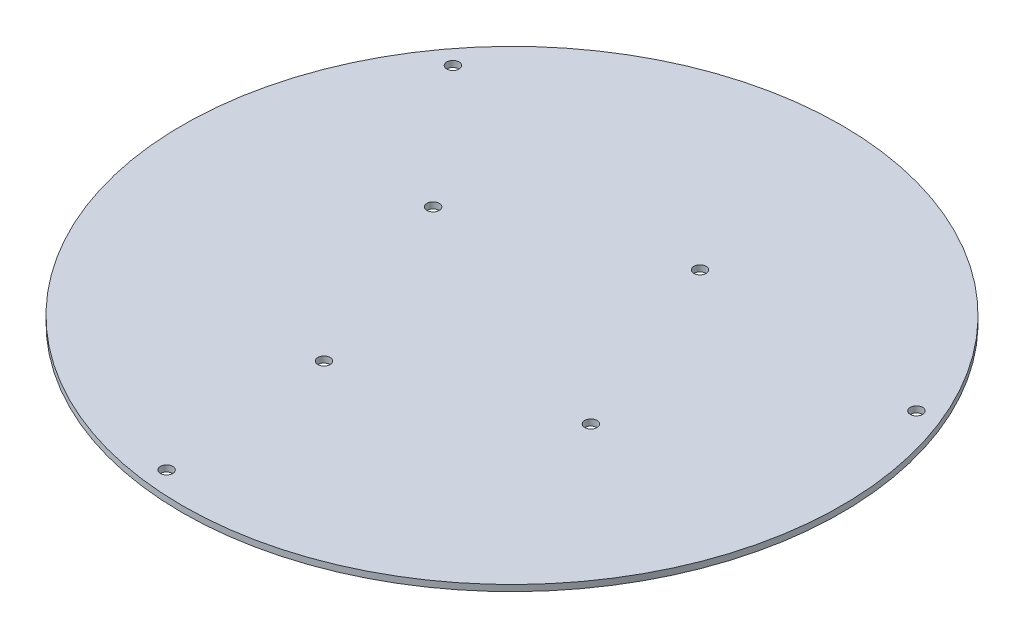
ISO-10303-21;
HEADER;
FILE_DESCRIPTION(('STEP AP214'),'2;1');
FILE_NAME('part.step','',(''),(''),'','','');
FILE_SCHEMA(('AUTOMOTIVE_DESIGN { 1 0 10303 214 1 1 1 1 }'));
ENDSEC;
DATA;
#1=APPLICATION_CONTEXT('core data for automotive mechanical design processes');
#2=APPLICATION_PROTOCOL_DEFINITION('international standard','automotive_design',2000,#1);
#3=PRODUCT_CONTEXT('',#1,'mechanical');
#4=PRODUCT('Part','Part','',(#3));
#5=PRODUCT_RELATED_PRODUCT_CATEGORY('part','',(#4));
#6=PRODUCT_DEFINITION_FORMATION('','',#4);
#7=PRODUCT_DEFINITION_CONTEXT('part definition',#1,'design');
#8=PRODUCT_DEFINITION('design','',#6,#7);
#9=PRODUCT_DEFINITION_SHAPE('','',#8);
#10=(LENGTH_UNIT() NAMED_UNIT(*) SI_UNIT(.MILLI.,.METRE.));
#11=(NAMED_UNIT(*) PLANE_ANGLE_UNIT() SI_UNIT($,.RADIAN.));
#12=(NAMED_UNIT(*) SI_UNIT($,.STERADIAN.) SOLID_ANGLE_UNIT());
#13=UNCERTAINTY_MEASURE_WITH_UNIT(LENGTH_MEASURE(1.E-05),#10,'distance_accuracy_value','');
#14=(GEOMETRIC_REPRESENTATION_CONTEXT(3) GLOBAL_UNCERTAINTY_ASSIGNED_CONTEXT((#13)) GLOBAL_UNIT_ASSIGNED_CONTEXT((#10,
#11,#12)) REPRESENTATION_CONTEXT('',''));
#15=CARTESIAN_POINT('',(0.,0.,0.));
#16=DIRECTION('',(0.,0.,1.));
#17=DIRECTION('',(1.,0.,0.));
#18=AXIS2_PLACEMENT_3D('',#15,#16,#17);
#19=CARTESIAN_POINT('',(138.313767790444,3.,-58.0456857967166));
#20=DIRECTION('',(0.,-1.,0.));
#21=DIRECTION('',(0.,0.,-1.));
#22=AXIS2_PLACEMENT_3D('',#19,#20,#21);
#23=CYLINDRICAL_SURFACE('',#22,2.99999999999999);
#24=CARTESIAN_POINT('',(138.313767790444,3.,-58.0456857967166));
#25=DIRECTION('',(0.,1.,0.));
#26=DIRECTION('',(0.,0.,1.));
#27=AXIS2_PLACEMENT_3D('',#24,#25,#26);
#28=CIRCLE('',#27,2.99999999999999);
#29=CARTESIAN_POINT('',(138.313767790444,3.,-55.0456857967166));
#30=VERTEX_POINT('',#29);
#31=EDGE_CURVE('E49',#30,#30,#28,.T.);
#32=ORIENTED_EDGE('',*,*,#31,.T.);
#33=EDGE_LOOP('',(#32));
#34=FACE_BOUND('',#33,.T.);
#35=CARTESIAN_POINT('',(138.313767790444,0.,-58.0456857967166));
#36=DIRECTION('',(0.,1.,0.));
#37=DIRECTION('',(0.,0.,1.));
#38=AXIS2_PLACEMENT_3D('',#35,#36,#37);
#39=CIRCLE('',#38,2.99999999999999);
#40=CARTESIAN_POINT('',(138.313767790444,0.,-55.0456857967166));
#41=VERTEX_POINT('',#40);
#42=EDGE_CURVE('E75',#41,#41,#39,.T.);
#43=ORIENTED_EDGE('',*,*,#42,.F.);
#44=EDGE_LOOP('',(#43));
#45=FACE_BOUND('',#44,.T.);
#46=ADVANCED_FACE('F41',(#34,#45),#23,.F.);
#47=CARTESIAN_POINT('',(-18.8878454151745,3.,148.806079498025));
#48=DIRECTION('',(0.,-1.,0.));
#49=DIRECTION('',(0.,0.,-1.));
#50=AXIS2_PLACEMENT_3D('',#47,#48,#49);
#51=CYLINDRICAL_SURFACE('',#50,3.);
#52=CARTESIAN_POINT('',(-18.8878454151745,3.,148.806079498025));
#53=DIRECTION('',(0.,1.,0.));
#54=DIRECTION('',(0.,0.,1.));
#55=AXIS2_PLACEMENT_3D('',#52,#53,#54);
#56=CIRCLE('',#55,3.);
#57=CARTESIAN_POINT('',(-18.8878454151745,3.,151.806079498025));
#58=VERTEX_POINT('',#57);
#59=EDGE_CURVE('E54',#58,#58,#56,.T.);
#60=ORIENTED_EDGE('',*,*,#59,.T.);
#61=EDGE_LOOP('',(#60));
#62=FACE_BOUND('',#61,.T.);
#63=CARTESIAN_POINT('',(-18.8878454151745,0.,148.806079498025));
#64=DIRECTION('',(0.,1.,0.));
#65=DIRECTION('',(0.,0.,1.));
#66=AXIS2_PLACEMENT_3D('',#63,#64,#65);
#67=CIRCLE('',#66,3.);
#68=CARTESIAN_POINT('',(-18.8878454151745,0.,151.806079498025));
#69=VERTEX_POINT('',#68);
#70=EDGE_CURVE('E73',#69,#69,#67,.T.);
#71=ORIENTED_EDGE('',*,*,#70,.F.);
#72=EDGE_LOOP('',(#71));
#73=FACE_BOUND('',#72,.T.);
#74=ADVANCED_FACE('F102',(#62,#73),#51,.F.);
#75=CARTESIAN_POINT('',(-64.7948768944695,3.,-26.4881846911137));
#76=DIRECTION('',(0.,-1.,0.));
#77=DIRECTION('',(0.,0.,-1.));
#78=AXIS2_PLACEMENT_3D('',#75,#76,#77);
#79=CYLINDRICAL_SURFACE('',#78,3.00000000000001);
#80=CARTESIAN_POINT('',(-64.7948768944695,3.,-26.4881846911137));
#81=DIRECTION('',(0.,1.,0.));
#82=DIRECTION('',(0.,0.,1.));
#83=AXIS2_PLACEMENT_3D('',#80,#81,#82);
#84=CIRCLE('',#83,3.00000000000001);
#85=CARTESIAN_POINT('',(-64.7948768944695,3.,-23.4881846911137));
#86=VERTEX_POINT('',#85);
#87=EDGE_CURVE('E97',#86,#86,#84,.T.);
#88=ORIENTED_EDGE('',*,*,#87,.T.);
#89=EDGE_LOOP('',(#88));
#90=FACE_BOUND('',#89,.T.);
#91=CARTESIAN_POINT('',(-64.7948768944695,0.,-26.4881846911137));
#92=DIRECTION('',(0.,1.,0.));
#93=DIRECTION('',(0.,0.,1.));
#94=AXIS2_PLACEMENT_3D('',#91,#92,#93);
#95=CIRCLE('',#94,3.00000000000001);
#96=CARTESIAN_POINT('',(-64.7948768944695,0.,-23.4881846911137));
#97=VERTEX_POINT('',#96);
#98=EDGE_CURVE('E70',#97,#97,#95,.T.);
#99=ORIENTED_EDGE('',*,*,#98,.F.);
#100=EDGE_LOOP('',(#99));
#101=FACE_BOUND('',#100,.T.);
#102=ADVANCED_FACE('F120',(#90,#101),#79,.F.);
#103=CARTESIAN_POINT('',(26.4881846911135,3.,-64.7948768944696));
#104=DIRECTION('',(0.,-1.,0.));
#105=DIRECTION('',(0.,0.,-1.));
#106=AXIS2_PLACEMENT_3D('',#103,#104,#105);
#107=CYLINDRICAL_SURFACE('',#106,2.99999999999999);
#108=CARTESIAN_POINT('',(26.4881846911135,3.,-64.7948768944696));
#109=DIRECTION('',(0.,1.,0.));
#110=DIRECTION('',(0.,0.,1.));
#111=AXIS2_PLACEMENT_3D('',#108,#109,#110);
#112=CIRCLE('',#111,2.99999999999999);
#113=CARTESIAN_POINT('',(26.4881846911135,3.,-61.7948768944696));
#114=VERTEX_POINT('',#113);
#115=EDGE_CURVE('E94',#114,#114,#112,.T.);
#116=ORIENTED_EDGE('',*,*,#115,.T.);
#117=EDGE_LOOP('',(#116));
#118=FACE_BOUND('',#117,.T.);
#119=CARTESIAN_POINT('',(26.4881846911135,0.,-64.7948768944696));
#120=DIRECTION('',(0.,1.,0.));
#121=DIRECTION('',(0.,0.,1.));
#122=AXIS2_PLACEMENT_3D('',#119,#120,#121);
#123=CIRCLE('',#122,2.99999999999999);
#124=CARTESIAN_POINT('',(26.4881846911135,0.,-61.7948768944696));
#125=VERTEX_POINT('',#124);
#126=EDGE_CURVE('E67',#125,#125,#123,.T.);
#127=ORIENTED_EDGE('',*,*,#126,.F.);
#128=EDGE_LOOP('',(#127));
#129=FACE_BOUND('',#128,.T.);
#130=ADVANCED_FACE('F127',(#118,#129),#107,.F.);
#131=CARTESIAN_POINT('',(64.7948768944695,3.,26.4881846911137));
#132=DIRECTION('',(0.,-1.,0.));
#133=DIRECTION('',(0.,0.,-1.));
#134=AXIS2_PLACEMENT_3D('',#131,#132,#133);
#135=CYLINDRICAL_SURFACE('',#134,3.00000000000001);
#136=CARTESIAN_POINT('',(64.7948768944695,3.,26.4881846911137));
#137=DIRECTION('',(0.,1.,0.));
#138=DIRECTION('',(0.,0.,1.));
#139=AXIS2_PLACEMENT_3D('',#136,#137,#138);
#140=CIRCLE('',#139,3.00000000000001);
#141=CARTESIAN_POINT('',(64.7948768944695,3.,29.4881846911137));
#142=VERTEX_POINT('',#141);
#143=EDGE_CURVE('E89',#142,#142,#140,.T.);
#144=ORIENTED_EDGE('',*,*,#143,.T.);
#145=EDGE_LOOP('',(#144));
#146=FACE_BOUND('',#145,.T.);
#147=CARTESIAN_POINT('',(64.7948768944695,0.,26.4881846911137));
#148=DIRECTION('',(0.,1.,0.));
#149=DIRECTION('',(0.,0.,1.));
#150=AXIS2_PLACEMENT_3D('',#147,#148,#149);
#151=CIRCLE('',#150,3.00000000000001);
#152=CARTESIAN_POINT('',(64.7948768944695,0.,29.4881846911137));
#153=VERTEX_POINT('',#152);
#154=EDGE_CURVE('E64',#153,#153,#151,.T.);
#155=ORIENTED_EDGE('',*,*,#154,.F.);
#156=EDGE_LOOP('',(#155));
#157=FACE_BOUND('',#156,.T.);
#158=ADVANCED_FACE('F131',(#146,#157),#135,.F.);
#159=CARTESIAN_POINT('',(-26.4881846911134,3.,64.7948768944696));
#160=DIRECTION('',(0.,-1.,0.));
#161=DIRECTION('',(0.,0.,-1.));
#162=AXIS2_PLACEMENT_3D('',#159,#160,#161);
#163=CYLINDRICAL_SURFACE('',#162,3.00000000000036);
#164=CARTESIAN_POINT('',(-26.4881846911134,3.,64.7948768944696));
#165=DIRECTION('',(0.,1.,0.));
#166=DIRECTION('',(0.,0.,1.));
#167=AXIS2_PLACEMENT_3D('',#164,#165,#166);
#168=CIRCLE('',#167,3.00000000000036);
#169=CARTESIAN_POINT('',(-26.4881846911134,3.,67.7948768944699));
#170=VERTEX_POINT('',#169);
#171=EDGE_CURVE('E84',#170,#170,#168,.T.);
#172=ORIENTED_EDGE('',*,*,#171,.T.);
#173=EDGE_LOOP('',(#172));
#174=FACE_BOUND('',#173,.T.);
#175=CARTESIAN_POINT('',(-26.4881846911134,0.,64.7948768944696));
#176=DIRECTION('',(0.,1.,0.));
#177=DIRECTION('',(0.,0.,1.));
#178=AXIS2_PLACEMENT_3D('',#175,#176,#177);
#179=CIRCLE('',#178,3.00000000000036);
#180=CARTESIAN_POINT('',(-26.4881846911134,0.,67.7948768944699));
#181=VERTEX_POINT('',#180);
#182=EDGE_CURVE('E61',#181,#181,#179,.T.);
#183=ORIENTED_EDGE('',*,*,#182,.F.);
#184=EDGE_LOOP('',(#183));
#185=FACE_BOUND('',#184,.T.);
#186=ADVANCED_FACE('F134',(#174,#185),#163,.F.);
#187=CARTESIAN_POINT('',(-119.425922375269,3.,-90.7603937013075));
#188=DIRECTION('',(0.,-1.,0.));
#189=DIRECTION('',(0.,0.,-1.));
#190=AXIS2_PLACEMENT_3D('',#187,#188,#189);
#191=CYLINDRICAL_SURFACE('',#190,3.00000000000001);
#192=CARTESIAN_POINT('',(-119.425922375269,3.,-90.7603937013075));
#193=DIRECTION('',(0.,1.,0.));
#194=DIRECTION('',(0.,0.,1.));
#195=AXIS2_PLACEMENT_3D('',#192,#193,#194);
#196=CIRCLE('',#195,3.00000000000001);
#197=CARTESIAN_POINT('',(-119.425922375269,3.,-87.7603937013075));
#198=VERTEX_POINT('',#197);
#199=EDGE_CURVE('E80',#198,#198,#196,.T.);
#200=ORIENTED_EDGE('',*,*,#199,.T.);
#201=EDGE_LOOP('',(#200));
#202=FACE_BOUND('',#201,.T.);
#203=CARTESIAN_POINT('',(-119.425922375269,0.,-90.7603937013075));
#204=DIRECTION('',(0.,1.,0.));
#205=DIRECTION('',(0.,0.,1.));
#206=AXIS2_PLACEMENT_3D('',#203,#204,#205);
#207=CIRCLE('',#206,3.00000000000001);
#208=CARTESIAN_POINT('',(-119.425922375269,0.,-87.7603937013075));
#209=VERTEX_POINT('',#208);
#210=EDGE_CURVE('E58',#209,#209,#207,.T.);
#211=ORIENTED_EDGE('',*,*,#210,.F.);
#212=EDGE_LOOP('',(#211));
#213=FACE_BOUND('',#212,.T.);
#214=ADVANCED_FACE('F43',(#202,#213),#191,.F.);
#215=CARTESIAN_POINT('',(4.09549311331298E-13,3.,9.75891792278861E-13));
#216=DIRECTION('',(0.,-1.,0.));
#217=DIRECTION('',(0.,0.,-1.));
#218=AXIS2_PLACEMENT_3D('',#215,#216,#217);
#219=CYLINDRICAL_SURFACE('',#218,160.);
#220=CARTESIAN_POINT('',(4.09549311331298E-13,3.,9.75891792278861E-13));
#221=DIRECTION('',(0.,1.,0.));
#222=DIRECTION('',(0.,0.,1.));
#223=AXIS2_PLACEMENT_3D('',#220,#221,#222);
#224=CIRCLE('',#223,160.);
#225=CARTESIAN_POINT('',(4.09549311331298E-13,3.,160.000000000001));
#226=VERTEX_POINT('',#225);
#227=EDGE_CURVE('E10',#226,#226,#224,.T.);
#228=ORIENTED_EDGE('',*,*,#227,.F.);
#229=EDGE_LOOP('',(#228));
#230=FACE_BOUND('',#229,.T.);
#231=CARTESIAN_POINT('',(4.09549311331298E-13,0.,9.75891792278861E-13));
#232=DIRECTION('',(0.,1.,0.));
#233=DIRECTION('',(0.,0.,1.));
#234=AXIS2_PLACEMENT_3D('',#231,#232,#233);
#235=CIRCLE('',#234,160.);
#236=CARTESIAN_POINT('',(4.09549311331298E-13,0.,160.000000000001));
#237=VERTEX_POINT('',#236);
#238=EDGE_CURVE('E45',#237,#237,#235,.T.);
#239=ORIENTED_EDGE('',*,*,#238,.T.);
#240=EDGE_LOOP('',(#239));
#241=FACE_BOUND('',#240,.T.);
#242=ADVANCED_FACE('F109',(#230,#241),#219,.T.);
#243=CARTESIAN_POINT('',(0.,3.,0.));
#244=DIRECTION('',(0.,1.,0.));
#245=DIRECTION('',(0.,0.,1.));
#246=AXIS2_PLACEMENT_3D('',#243,#244,#245);
#247=PLANE('',#246);
#248=ORIENTED_EDGE('',*,*,#199,.F.);
#249=EDGE_LOOP('',(#248));
#250=FACE_BOUND('',#249,.T.);
#251=ORIENTED_EDGE('',*,*,#171,.F.);
#252=EDGE_LOOP('',(#251));
#253=FACE_BOUND('',#252,.T.);
#254=ORIENTED_EDGE('',*,*,#143,.F.);
#255=EDGE_LOOP('',(#254));
#256=FACE_BOUND('',#255,.T.);
#257=ORIENTED_EDGE('',*,*,#115,.F.);
#258=EDGE_LOOP('',(#257));
#259=FACE_BOUND('',#258,.T.);
#260=ORIENTED_EDGE('',*,*,#87,.F.);
#261=EDGE_LOOP('',(#260));
#262=FACE_BOUND('',#261,.T.);
#263=ORIENTED_EDGE('',*,*,#59,.F.);
#264=EDGE_LOOP('',(#263));
#265=FACE_BOUND('',#264,.T.);
#266=ORIENTED_EDGE('',*,*,#31,.F.);
#267=EDGE_LOOP('',(#266));
#268=FACE_BOUND('',#267,.T.);
#269=ORIENTED_EDGE('',*,*,#227,.T.);
#270=EDGE_LOOP('',(#269));
#271=FACE_BOUND('',#270,.T.);
#272=ADVANCED_FACE('F105',(#250,#253,#256,#259,#262,#265,#268,#271),#247,.T.);
#273=CARTESIAN_POINT('',(0.,0.,0.));
#274=DIRECTION('',(0.,1.,0.));
#275=DIRECTION('',(0.,0.,1.));
#276=AXIS2_PLACEMENT_3D('',#273,#274,#275);
#277=PLANE('',#276);
#278=ORIENTED_EDGE('',*,*,#210,.T.);
#279=EDGE_LOOP('',(#278));
#280=FACE_BOUND('',#279,.T.);
#281=ORIENTED_EDGE('',*,*,#182,.T.);
#282=EDGE_LOOP('',(#281));
#283=FACE_BOUND('',#282,.T.);
#284=ORIENTED_EDGE('',*,*,#154,.T.);
#285=EDGE_LOOP('',(#284));
#286=FACE_BOUND('',#285,.T.);
#287=ORIENTED_EDGE('',*,*,#126,.T.);
#288=EDGE_LOOP('',(#287));
#289=FACE_BOUND('',#288,.T.);
#290=ORIENTED_EDGE('',*,*,#98,.T.);
#291=EDGE_LOOP('',(#290));
#292=FACE_BOUND('',#291,.T.);
#293=ORIENTED_EDGE('',*,*,#70,.T.);
#294=EDGE_LOOP('',(#293));
#295=FACE_BOUND('',#294,.T.);
#296=ORIENTED_EDGE('',*,*,#42,.T.);
#297=EDGE_LOOP('',(#296));
#298=FACE_BOUND('',#297,.T.);
#299=ORIENTED_EDGE('',*,*,#238,.F.);
#300=EDGE_LOOP('',(#299));
#301=FACE_BOUND('',#300,.T.);
#302=ADVANCED_FACE('F108',(#280,#283,#286,#289,#292,#295,#298,#301),#277,.F.);
#303=CLOSED_SHELL('',(#46,#74,#102,#130,#158,#186,#214,#242,#272,#302));
#304=MANIFOLD_SOLID_BREP('B2',#303);
#305=ADVANCED_BREP_SHAPE_REPRESENTATION('',(#18,#304),#14);
#306=SHAPE_DEFINITION_REPRESENTATION(#9,#305);
ENDSEC;
END-ISO-10303-21;
